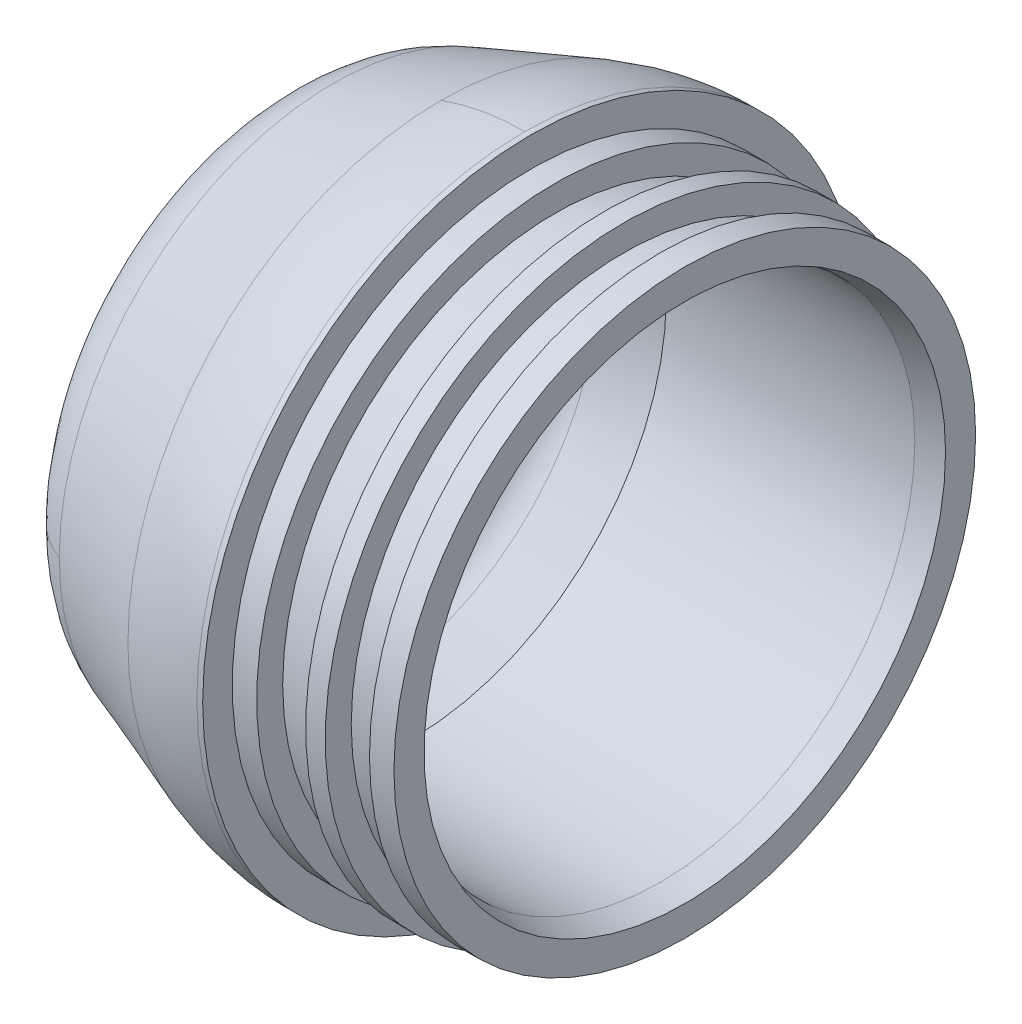
ISO-10303-21;
HEADER;
FILE_DESCRIPTION(('STEP AP214'),'2;1');
FILE_NAME('part.step','',(''),(''),'','','');
FILE_SCHEMA(('AUTOMOTIVE_DESIGN { 1 0 10303 214 1 1 1 1 }'));
ENDSEC;
DATA;
#1=APPLICATION_CONTEXT('core data for automotive mechanical design processes');
#2=APPLICATION_PROTOCOL_DEFINITION('international standard','automotive_design',2000,#1);
#3=PRODUCT_CONTEXT('',#1,'mechanical');
#4=PRODUCT('Part','Part','',(#3));
#5=PRODUCT_RELATED_PRODUCT_CATEGORY('part','',(#4));
#6=PRODUCT_DEFINITION_FORMATION('','',#4);
#7=PRODUCT_DEFINITION_CONTEXT('part definition',#1,'design');
#8=PRODUCT_DEFINITION('design','',#6,#7);
#9=PRODUCT_DEFINITION_SHAPE('','',#8);
#10=(LENGTH_UNIT() NAMED_UNIT(*) SI_UNIT(.MILLI.,.METRE.));
#11=(NAMED_UNIT(*) PLANE_ANGLE_UNIT() SI_UNIT($,.RADIAN.));
#12=(NAMED_UNIT(*) SI_UNIT($,.STERADIAN.) SOLID_ANGLE_UNIT());
#13=UNCERTAINTY_MEASURE_WITH_UNIT(LENGTH_MEASURE(1.E-05),#10,'distance_accuracy_value','');
#14=(GEOMETRIC_REPRESENTATION_CONTEXT(3) GLOBAL_UNCERTAINTY_ASSIGNED_CONTEXT((#13)) GLOBAL_UNIT_ASSIGNED_CONTEXT((#10,
#11,#12)) REPRESENTATION_CONTEXT('',''));
#15=CARTESIAN_POINT('',(0.,0.,0.));
#16=DIRECTION('',(0.,0.,1.));
#17=DIRECTION('',(1.,0.,0.));
#18=AXIS2_PLACEMENT_3D('',#15,#16,#17);
#19=CARTESIAN_POINT('',(50.00625,0.,0.));
#20=DIRECTION('',(1.,0.,0.));
#21=DIRECTION('',(0.,0.,-1.));
#22=AXIS2_PLACEMENT_3D('',#19,#20,#21);
#23=CYLINDRICAL_SURFACE('',#22,17.669740938);
#24=CARTESIAN_POINT('',(50.00625,0.,0.));
#25=DIRECTION('',(1.,0.,0.));
#26=DIRECTION('',(0.,0.,-1.));
#27=AXIS2_PLACEMENT_3D('',#24,#25,#26);
#28=CIRCLE('',#27,17.669740938);
#29=CARTESIAN_POINT('',(50.00625,0.,-17.669740938));
#30=VERTEX_POINT('',#29);
#31=EDGE_CURVE('E265',#30,#30,#28,.F.);
#32=ORIENTED_EDGE('',*,*,#31,.F.);
#33=EDGE_LOOP('',(#32));
#34=FACE_BOUND('',#33,.T.);
#35=CARTESIAN_POINT('',(52.3875,0.,0.));
#36=DIRECTION('',(1.,0.,0.));
#37=DIRECTION('',(0.,0.,-1.));
#38=AXIS2_PLACEMENT_3D('',#35,#36,#37);
#39=CIRCLE('',#38,17.669740938);
#40=CARTESIAN_POINT('',(52.3875,0.,-17.669740938));
#41=VERTEX_POINT('',#40);
#42=EDGE_CURVE('E21',#41,#41,#39,.T.);
#43=ORIENTED_EDGE('',*,*,#42,.F.);
#44=EDGE_LOOP('',(#43));
#45=FACE_BOUND('',#44,.T.);
#46=ADVANCED_FACE('F16',(#34,#45),#23,.T.);
#47=CARTESIAN_POINT('',(52.3875,-19.09401224,-19.09401224));
#48=DIRECTION('',(-1.,0.,0.));
#49=DIRECTION('',(0.,0.,1.));
#50=AXIS2_PLACEMENT_3D('',#47,#48,#49);
#51=PLANE('',#50);
#52=ORIENTED_EDGE('',*,*,#42,.T.);
#53=EDGE_LOOP('',(#52));
#54=FACE_BOUND('',#53,.T.);
#55=CARTESIAN_POINT('',(52.3875,0.,0.));
#56=DIRECTION('',(1.,0.,0.));
#57=DIRECTION('',(0.,0.,-1.));
#58=AXIS2_PLACEMENT_3D('',#55,#56,#57);
#59=CIRCLE('',#58,18.867601028);
#60=CARTESIAN_POINT('',(52.3875,0.,-18.867601028));
#61=VERTEX_POINT('',#60);
#62=EDGE_CURVE('E262',#61,#61,#59,.F.);
#63=ORIENTED_EDGE('',*,*,#62,.T.);
#64=EDGE_LOOP('',(#63));
#65=FACE_BOUND('',#64,.T.);
#66=ADVANCED_FACE('F175',(#54,#65),#51,.T.);
#67=CARTESIAN_POINT('',(50.00625,-19.5870576,19.5870576));
#68=DIRECTION('',(1.,0.,0.));
#69=DIRECTION('',(0.,0.,-1.));
#70=AXIS2_PLACEMENT_3D('',#67,#68,#69);
#71=PLANE('',#70);
#72=ORIENTED_EDGE('',*,*,#31,.T.);
#73=EDGE_LOOP('',(#72));
#74=FACE_BOUND('',#73,.T.);
#75=CARTESIAN_POINT('',(50.00625,0.,0.));
#76=DIRECTION('',(1.,0.,0.));
#77=DIRECTION('',(0.,0.,-1.));
#78=AXIS2_PLACEMENT_3D('',#75,#76,#77);
#79=CIRCLE('',#78,19.3548);
#80=CARTESIAN_POINT('',(50.00625,0.,-19.3548));
#81=VERTEX_POINT('',#80);
#82=EDGE_CURVE('E259',#81,#81,#79,.T.);
#83=ORIENTED_EDGE('',*,*,#82,.T.);
#84=EDGE_LOOP('',(#83));
#85=FACE_BOUND('',#84,.T.);
#86=ADVANCED_FACE('F171',(#74,#85),#71,.T.);
#87=CARTESIAN_POINT('',(52.3875,0.,0.));
#88=DIRECTION('',(1.,0.,0.));
#89=DIRECTION('',(0.,0.,-1.));
#90=AXIS2_PLACEMENT_3D('',#87,#88,#89);
#91=CYLINDRICAL_SURFACE('',#90,18.867601028);
#92=ORIENTED_EDGE('',*,*,#62,.F.);
#93=EDGE_LOOP('',(#92));
#94=FACE_BOUND('',#93,.T.);
#95=CARTESIAN_POINT('',(53.975,0.,0.));
#96=DIRECTION('',(1.,0.,0.));
#97=DIRECTION('',(0.,0.,-1.));
#98=AXIS2_PLACEMENT_3D('',#95,#96,#97);
#99=CIRCLE('',#98,18.867601028);
#100=CARTESIAN_POINT('',(53.975,0.,-18.867601028));
#101=VERTEX_POINT('',#100);
#102=EDGE_CURVE('E255',#101,#101,#99,.T.);
#103=ORIENTED_EDGE('',*,*,#102,.F.);
#104=EDGE_LOOP('',(#103));
#105=FACE_BOUND('',#104,.T.);
#106=ADVANCED_FACE('F167',(#94,#105),#91,.T.);
#107=CARTESIAN_POINT('',(48.73625,0.,0.));
#108=DIRECTION('',(1.,0.,0.));
#109=DIRECTION('',(0.,0.,-1.));
#110=AXIS2_PLACEMENT_3D('',#107,#108,#109);
#111=CYLINDRICAL_SURFACE('',#110,19.3548);
#112=CARTESIAN_POINT('',(48.73625,0.,0.));
#113=DIRECTION('',(1.,0.,0.));
#114=DIRECTION('',(0.,0.,-1.));
#115=AXIS2_PLACEMENT_3D('',#112,#113,#114);
#116=CIRCLE('',#115,19.3548);
#117=CARTESIAN_POINT('',(48.73625,0.,-19.3548));
#118=VERTEX_POINT('',#117);
#119=EDGE_CURVE('E251',#118,#118,#116,.F.);
#120=ORIENTED_EDGE('',*,*,#119,.F.);
#121=EDGE_LOOP('',(#120));
#122=FACE_BOUND('',#121,.T.);
#123=ORIENTED_EDGE('',*,*,#82,.F.);
#124=EDGE_LOOP('',(#123));
#125=FACE_BOUND('',#124,.T.);
#126=ADVANCED_FACE('F163',(#122,#125),#111,.T.);
#127=CARTESIAN_POINT('',(53.975,-19.09401224,19.09401224));
#128=DIRECTION('',(1.,0.,0.));
#129=DIRECTION('',(0.,0.,-1.));
#130=AXIS2_PLACEMENT_3D('',#127,#128,#129);
#131=PLANE('',#130);
#132=CARTESIAN_POINT('',(53.975,0.,0.));
#133=DIRECTION('',(1.,0.,0.));
#134=DIRECTION('',(0.,0.,-1.));
#135=AXIS2_PLACEMENT_3D('',#132,#133,#134);
#136=CIRCLE('',#135,16.9164);
#137=CARTESIAN_POINT('',(53.975,0.,-16.9164));
#138=VERTEX_POINT('',#137);
#139=EDGE_CURVE('E248',#138,#138,#136,.T.);
#140=ORIENTED_EDGE('',*,*,#139,.F.);
#141=EDGE_LOOP('',(#140));
#142=FACE_BOUND('',#141,.T.);
#143=ORIENTED_EDGE('',*,*,#102,.T.);
#144=EDGE_LOOP('',(#143));
#145=FACE_BOUND('',#144,.T.);
#146=ADVANCED_FACE('F166',(#142,#145),#131,.T.);
#147=CARTESIAN_POINT('',(48.73625,-19.5870576,-19.5870576));
#148=DIRECTION('',(-1.,0.,0.));
#149=DIRECTION('',(0.,0.,1.));
#150=AXIS2_PLACEMENT_3D('',#147,#148,#149);
#151=PLANE('',#150);
#152=CARTESIAN_POINT('',(48.7362499999999,0.,0.));
#153=DIRECTION('',(1.,0.,0.));
#154=DIRECTION('',(0.,0.,-1.));
#155=AXIS2_PLACEMENT_3D('',#152,#153,#154);
#156=CIRCLE('',#155,18.229579102);
#157=CARTESIAN_POINT('',(48.7362499999999,0.,-18.229579102));
#158=VERTEX_POINT('',#157);
#159=EDGE_CURVE('E244',#158,#158,#156,.T.);
#160=ORIENTED_EDGE('',*,*,#159,.T.);
#161=EDGE_LOOP('',(#160));
#162=FACE_BOUND('',#161,.T.);
#163=ORIENTED_EDGE('',*,*,#119,.T.);
#164=EDGE_LOOP('',(#163));
#165=FACE_BOUND('',#164,.T.);
#166=ADVANCED_FACE('F161',(#162,#165),#151,.T.);
#167=CARTESIAN_POINT('',(52.3875,0.,0.));
#168=DIRECTION('',(1.,0.,0.));
#169=DIRECTION('',(0.,0.,-1.));
#170=AXIS2_PLACEMENT_3D('',#167,#168,#169);
#171=CONICAL_SURFACE('',#170,16.51,0.250617701099011);
#172=ORIENTED_EDGE('',*,*,#139,.T.);
#173=EDGE_LOOP('',(#172));
#174=FACE_BOUND('',#173,.T.);
#175=CARTESIAN_POINT('',(52.3875,0.,0.));
#176=DIRECTION('',(1.,0.,0.));
#177=DIRECTION('',(0.,1.,0.));
#178=AXIS2_PLACEMENT_3D('',#175,#176,#177);
#179=CIRCLE('',#178,16.51);
#180=CARTESIAN_POINT('',(52.3875,16.51,0.));
#181=VERTEX_POINT('',#180);
#182=EDGE_CURVE('E243',#181,#181,#179,.T.);
#183=ORIENTED_EDGE('',*,*,#182,.F.);
#184=EDGE_LOOP('',(#183));
#185=FACE_BOUND('',#184,.T.);
#186=ADVANCED_FACE('F157',(#174,#185),#171,.F.);
#187=CARTESIAN_POINT('',(45.56125,0.,0.));
#188=DIRECTION('',(1.,0.,0.));
#189=DIRECTION('',(0.,0.,-1.));
#190=AXIS2_PLACEMENT_3D('',#187,#188,#189);
#191=CONICAL_SURFACE('',#190,17.669740939,0.174532924970526);
#192=CARTESIAN_POINT('',(45.56125,0.,0.));
#193=DIRECTION('',(1.,0.,0.));
#194=DIRECTION('',(0.,0.,-1.));
#195=AXIS2_PLACEMENT_3D('',#192,#193,#194);
#196=CIRCLE('',#195,17.669740939);
#197=CARTESIAN_POINT('',(45.56125,0.,-17.669740939));
#198=VERTEX_POINT('',#197);
#199=EDGE_CURVE('E239',#198,#198,#196,.F.);
#200=ORIENTED_EDGE('',*,*,#199,.F.);
#201=EDGE_LOOP('',(#200));
#202=FACE_BOUND('',#201,.T.);
#203=ORIENTED_EDGE('',*,*,#159,.F.);
#204=EDGE_LOOP('',(#203));
#205=FACE_BOUND('',#204,.T.);
#206=ADVANCED_FACE('F153',(#202,#205),#191,.T.);
#207=CARTESIAN_POINT('',(36.263698018,0.,0.));
#208=DIRECTION('',(1.,0.,0.));
#209=DIRECTION('',(0.,0.,-1.));
#210=AXIS2_PLACEMENT_3D('',#207,#208,#209);
#211=CYLINDRICAL_SURFACE('',#210,16.51);
#212=ORIENTED_EDGE('',*,*,#182,.T.);
#213=EDGE_LOOP('',(#212));
#214=FACE_BOUND('',#213,.T.);
#215=CARTESIAN_POINT('',(36.263698018,0.,0.));
#216=DIRECTION('',(1.,0.,0.));
#217=DIRECTION('',(0.,1.,0.));
#218=AXIS2_PLACEMENT_3D('',#215,#216,#217);
#219=CIRCLE('',#218,16.509999999);
#220=CARTESIAN_POINT('',(36.263698018,16.509999999,0.));
#221=VERTEX_POINT('',#220);
#222=EDGE_CURVE('E238',#221,#221,#219,.T.);
#223=ORIENTED_EDGE('',*,*,#222,.F.);
#224=EDGE_LOOP('',(#223));
#225=FACE_BOUND('',#224,.T.);
#226=ADVANCED_FACE('F150',(#214,#225),#211,.F.);
#227=CARTESIAN_POINT('',(45.56125,-19.5870576,19.5870576));
#228=DIRECTION('',(1.,0.,0.));
#229=DIRECTION('',(0.,0.,-1.));
#230=AXIS2_PLACEMENT_3D('',#227,#228,#229);
#231=PLANE('',#230);
#232=ORIENTED_EDGE('',*,*,#199,.T.);
#233=EDGE_LOOP('',(#232));
#234=FACE_BOUND('',#233,.T.);
#235=CARTESIAN_POINT('',(45.56125,0.,0.));
#236=DIRECTION('',(1.,0.,0.));
#237=DIRECTION('',(0.,0.,-1.));
#238=AXIS2_PLACEMENT_3D('',#235,#236,#237);
#239=CIRCLE('',#238,19.3548);
#240=CARTESIAN_POINT('',(45.56125,0.,-19.3548));
#241=VERTEX_POINT('',#240);
#242=EDGE_CURVE('E81',#241,#241,#239,.T.);
#243=ORIENTED_EDGE('',*,*,#242,.T.);
#244=EDGE_LOOP('',(#243));
#245=FACE_BOUND('',#244,.T.);
#246=ADVANCED_FACE('F148',(#234,#245),#231,.T.);
#247=CARTESIAN_POINT('',(33.045336045,0.,0.));
#248=DIRECTION('',(1.,0.,0.));
#249=DIRECTION('',(0.,0.,-1.));
#250=AXIS2_PLACEMENT_3D('',#247,#248,#249);
#251=CONICAL_SURFACE('',#250,15.338612039,0.349065850051445);
#252=ORIENTED_EDGE('',*,*,#222,.T.);
#253=EDGE_LOOP('',(#252));
#254=FACE_BOUND('',#253,.T.);
#255=CARTESIAN_POINT('',(33.0453360451629,0.,0.));
#256=DIRECTION('',(-1.,0.,0.));
#257=DIRECTION('',(0.,0.,1.));
#258=AXIS2_PLACEMENT_3D('',#255,#256,#257);
#259=CIRCLE('',#258,15.3386120388692);
#260=CARTESIAN_POINT('',(33.0453360451629,0.,15.3386120388692));
#261=VERTEX_POINT('',#260);
#262=CARTESIAN_POINT('',(33.0453360451629,0.,-15.3386120388692));
#263=VERTEX_POINT('',#262);
#264=EDGE_CURVE('E69',#261,#263,#259,.T.);
#265=ORIENTED_EDGE('',*,*,#264,.T.);
#266=CARTESIAN_POINT('',(33.0453360451629,0.,0.));
#267=DIRECTION('',(-1.,0.,0.));
#268=DIRECTION('',(0.,0.,1.));
#269=AXIS2_PLACEMENT_3D('',#266,#267,#268);
#270=CIRCLE('',#269,15.3386120388692);
#271=EDGE_CURVE('E74',#263,#261,#270,.T.);
#272=ORIENTED_EDGE('',*,*,#271,.T.);
#273=EDGE_LOOP('',(#265,#272));
#274=FACE_BOUND('',#273,.T.);
#275=ADVANCED_FACE('F83',(#254,#274),#251,.F.);
#276=CARTESIAN_POINT('',(43.97375,0.,0.));
#277=DIRECTION('',(1.,0.,0.));
#278=DIRECTION('',(0.,0.,-1.));
#279=AXIS2_PLACEMENT_3D('',#276,#277,#278);
#280=CYLINDRICAL_SURFACE('',#279,19.3548);
#281=ORIENTED_EDGE('',*,*,#242,.F.);
#282=EDGE_LOOP('',(#281));
#283=FACE_BOUND('',#282,.T.);
#284=CARTESIAN_POINT('',(43.97375,0.,0.));
#285=DIRECTION('',(1.,0.,0.));
#286=DIRECTION('',(0.,0.,-1.));
#287=AXIS2_PLACEMENT_3D('',#284,#285,#286);
#288=CIRCLE('',#287,19.3548);
#289=CARTESIAN_POINT('',(43.97375,0.,-19.3548));
#290=VERTEX_POINT('',#289);
#291=EDGE_CURVE('E96',#290,#290,#288,.F.);
#292=ORIENTED_EDGE('',*,*,#291,.F.);
#293=EDGE_LOOP('',(#292));
#294=FACE_BOUND('',#293,.T.);
#295=ADVANCED_FACE('F133',(#283,#294),#280,.T.);
#296=CARTESIAN_POINT('',(33.348616493,0.,15.432117346));
#297=CARTESIAN_POINT('',(33.348616493,-30.864234692,15.432117346));
#298=CARTESIAN_POINT('',(33.348616493,-30.864234692,-15.432117346));
#299=CARTESIAN_POINT('',(33.348616493,0.,-15.432117346));
#300=CARTESIAN_POINT('',(31.752389926,0.,15.026121743));
#301=CARTESIAN_POINT('',(31.752389926,-30.052243487,15.026121743));
#302=CARTESIAN_POINT('',(31.752389926,-30.052243487,-15.026121743));
#303=CARTESIAN_POINT('',(31.752389926,0.,-15.026121743));
#304=CARTESIAN_POINT('',(30.807681208,0.,13.676937871));
#305=CARTESIAN_POINT('',(30.807681208,-27.353875742,13.676937871));
#306=CARTESIAN_POINT('',(30.807681208,-27.353875742,-13.676937871));
#307=CARTESIAN_POINT('',(30.807681208,0.,-13.676937871));
#308=CARTESIAN_POINT('',(30.972111775,0.,12.03811687));
#309=CARTESIAN_POINT('',(30.972111775,-24.07623374,12.03811687));
#310=CARTESIAN_POINT('',(30.972111775,-24.07623374,-12.03811687));
#311=CARTESIAN_POINT('',(30.972111775,0.,-12.03811687));
#312=(BOUNDED_SURFACE() B_SPLINE_SURFACE(3,3,((#296,#297,#298,#299),(#300,#301,#302,#303),(#304,
#305,#306,#307),(#308,#309,#310,#311)),.UNSPECIFIED.,.F.,.F.,
.F.) B_SPLINE_SURFACE_WITH_KNOTS((4,4),(4,4),(0.,1.),(0.,1.),
.UNSPECIFIED.) GEOMETRIC_REPRESENTATION_ITEM() RATIONAL_B_SPLINE_SURFACE(((1.,0.333333333333333,
0.333333333333333,1.),(0.838531733818192,0.279510577939397,0.279510577939397,0.838531733818192),
(0.838531733818192,0.279510577939397,0.279510577939397,0.838531733818192),(1.,0.333333333333333,
0.333333333333333,1.))) REPRESENTATION_ITEM('') SURFACE());
#313=CARTESIAN_POINT('',(33.348616493,0.,15.432117346));
#314=CARTESIAN_POINT('',(31.752389926,0.,15.026121743));
#315=CARTESIAN_POINT('',(30.807681208,0.,13.676937871));
#316=CARTESIAN_POINT('',(30.972111775,0.,12.03811687));
#317=(BOUNDED_CURVE() B_SPLINE_CURVE(3,(#313,#314,#315,#316),.UNSPECIFIED.,.F.,
.F.) B_SPLINE_CURVE_WITH_KNOTS((4,4),(0.,1.),
.UNSPECIFIED.) CURVE() GEOMETRIC_REPRESENTATION_ITEM() RATIONAL_B_SPLINE_CURVE((1.,
0.838531733818192,0.838531733818192,1.)) REPRESENTATION_ITEM(''));
#318=CARTESIAN_POINT('',(30.9562499999328,0.,12.3550879650064));
#319=VERTEX_POINT('',#318);
#320=EDGE_CURVE('E78',#319,#261,#317,.F.);
#321=CARTESIAN_POINT('',(33.348616493,0.,-15.432117346));
#322=CARTESIAN_POINT('',(31.752389926,0.,-15.026121743));
#323=CARTESIAN_POINT('',(30.807681208,0.,-13.676937871));
#324=CARTESIAN_POINT('',(30.972111775,0.,-12.03811687));
#325=(BOUNDED_CURVE() B_SPLINE_CURVE(3,(#321,#322,#323,#324),.UNSPECIFIED.,.F.,
.F.) B_SPLINE_CURVE_WITH_KNOTS((4,4),(0.,1.),
.UNSPECIFIED.) CURVE() GEOMETRIC_REPRESENTATION_ITEM() RATIONAL_B_SPLINE_CURVE((1.,
0.838531733818192,0.838531733818192,1.)) REPRESENTATION_ITEM(''));
#326=CARTESIAN_POINT('',(30.9562499999328,0.,-12.3550879650064));
#327=VERTEX_POINT('',#326);
#328=EDGE_CURVE('E76',#263,#327,#325,.T.);
#329=CARTESIAN_POINT('',(30.956249999888,0.,-12.3550879675008));
#330=CARTESIAN_POINT('',(30.956249999888,-24.7101759350153,-12.3550879675008));
#331=CARTESIAN_POINT('',(30.956249999888,-24.7101759350153,12.3550879675008));
#332=CARTESIAN_POINT('',(30.956249999888,0.,12.3550879675008));
#333=(BOUNDED_CURVE() B_SPLINE_CURVE(3,(#329,#330,#331,#332),.UNSPECIFIED.,.F.,
.F.) B_SPLINE_CURVE_WITH_KNOTS((4,4),(0.,1.),
.UNSPECIFIED.) CURVE() GEOMETRIC_REPRESENTATION_ITEM() RATIONAL_B_SPLINE_CURVE((0.966273053591873,
0.322091017863957,0.322091017863957,0.966273053591873)) REPRESENTATION_ITEM(''));
#334=EDGE_CURVE('E118',#319,#327,#333,.F.);
#335=ORIENTED_EDGE('',*,*,#320,.T.);
#336=ORIENTED_EDGE('',*,*,#271,.F.);
#337=ORIENTED_EDGE('',*,*,#328,.T.);
#338=ORIENTED_EDGE('',*,*,#334,.F.);
#339=EDGE_LOOP('',(#335,#336,#337,#338));
#340=FACE_BOUND('',#339,.T.);
#341=ADVANCED_FACE('F75',(#340),#312,.F.);
#342=CARTESIAN_POINT('',(33.348616493,0.,-15.432117346));
#343=CARTESIAN_POINT('',(33.348616493,30.864234692,-15.432117346));
#344=CARTESIAN_POINT('',(33.348616493,30.864234692,15.432117346));
#345=CARTESIAN_POINT('',(33.348616493,0.,15.432117346));
#346=CARTESIAN_POINT('',(31.752389926,0.,-15.026121743));
#347=CARTESIAN_POINT('',(31.752389926,30.052243487,-15.026121743));
#348=CARTESIAN_POINT('',(31.752389926,30.052243487,15.026121743));
#349=CARTESIAN_POINT('',(31.752389926,0.,15.026121743));
#350=CARTESIAN_POINT('',(30.807681208,0.,-13.676937871));
#351=CARTESIAN_POINT('',(30.807681208,27.353875742,-13.676937871));
#352=CARTESIAN_POINT('',(30.807681208,27.353875742,13.676937871));
#353=CARTESIAN_POINT('',(30.807681208,0.,13.676937871));
#354=CARTESIAN_POINT('',(30.972111775,0.,-12.03811687));
#355=CARTESIAN_POINT('',(30.972111775,24.07623374,-12.03811687));
#356=CARTESIAN_POINT('',(30.972111775,24.07623374,12.03811687));
#357=CARTESIAN_POINT('',(30.972111775,0.,12.03811687));
#358=(BOUNDED_SURFACE() B_SPLINE_SURFACE(3,3,((#342,#343,#344,#345),(#346,#347,#348,#349),(#350,
#351,#352,#353),(#354,#355,#356,#357)),.UNSPECIFIED.,.F.,.F.,
.F.) B_SPLINE_SURFACE_WITH_KNOTS((4,4),(4,4),(0.,1.),(0.,1.),
.UNSPECIFIED.) GEOMETRIC_REPRESENTATION_ITEM() RATIONAL_B_SPLINE_SURFACE(((1.,0.333333333333333,
0.333333333333333,1.),(0.838531733818192,0.279510577939397,0.279510577939397,0.838531733818192),
(0.838531733818192,0.279510577939397,0.279510577939397,0.838531733818192),(1.,0.333333333333333,
0.333333333333333,1.))) REPRESENTATION_ITEM('') SURFACE());
#359=CARTESIAN_POINT('',(30.956249999888,0.,12.3550879675008));
#360=CARTESIAN_POINT('',(30.956249999888,24.7101759350153,12.3550879675008));
#361=CARTESIAN_POINT('',(30.956249999888,24.7101759350153,-12.3550879675008));
#362=CARTESIAN_POINT('',(30.956249999888,0.,-12.3550879675008));
#363=(BOUNDED_CURVE() B_SPLINE_CURVE(3,(#359,#360,#361,#362),.UNSPECIFIED.,.F.,
.F.) B_SPLINE_CURVE_WITH_KNOTS((4,4),(0.,1.),
.UNSPECIFIED.) CURVE() GEOMETRIC_REPRESENTATION_ITEM() RATIONAL_B_SPLINE_CURVE((0.966273053591873,
0.322091017863957,0.322091017863957,0.966273053591873)) REPRESENTATION_ITEM(''));
#364=EDGE_CURVE('E88',#327,#319,#363,.F.);
#365=ORIENTED_EDGE('',*,*,#364,.F.);
#366=ORIENTED_EDGE('',*,*,#328,.F.);
#367=ORIENTED_EDGE('',*,*,#264,.F.);
#368=ORIENTED_EDGE('',*,*,#320,.F.);
#369=EDGE_LOOP('',(#365,#366,#367,#368));
#370=FACE_BOUND('',#369,.T.);
#371=ADVANCED_FACE('F86',(#370),#358,.F.);
#372=CARTESIAN_POINT('',(43.97375,-21.52777,21.52777));
#373=DIRECTION('',(1.,0.,0.));
#374=DIRECTION('',(0.,0.,-1.));
#375=AXIS2_PLACEMENT_3D('',#372,#373,#374);
#376=PLANE('',#375);
#377=ORIENTED_EDGE('',*,*,#291,.T.);
#378=EDGE_LOOP('',(#377));
#379=FACE_BOUND('',#378,.T.);
#380=CARTESIAN_POINT('',(43.97375,0.,0.));
#381=DIRECTION('',(1.,0.,0.));
#382=DIRECTION('',(0.,0.,-1.));
#383=AXIS2_PLACEMENT_3D('',#380,#381,#382);
#384=CIRCLE('',#383,21.2725);
#385=CARTESIAN_POINT('',(43.97375,0.,-21.2725));
#386=VERTEX_POINT('',#385);
#387=EDGE_CURVE('E218',#386,#386,#384,.T.);
#388=ORIENTED_EDGE('',*,*,#387,.T.);
#389=EDGE_LOOP('',(#388));
#390=FACE_BOUND('',#389,.T.);
#391=ADVANCED_FACE('F192',(#379,#390),#376,.T.);
#392=CARTESIAN_POINT('',(30.95625,-12.503349023,12.503349023));
#393=DIRECTION('',(1.,0.,0.));
#394=DIRECTION('',(0.,0.,-1.));
#395=AXIS2_PLACEMENT_3D('',#392,#393,#394);
#396=PLANE('',#395);
#397=CARTESIAN_POINT('',(30.95625,0.,0.));
#398=DIRECTION('',(1.,0.,0.));
#399=DIRECTION('',(0.,0.,-1.));
#400=AXIS2_PLACEMENT_3D('',#397,#398,#399);
#401=CIRCLE('',#400,5.588);
#402=CARTESIAN_POINT('',(30.95625,0.,-5.588));
#403=VERTEX_POINT('',#402);
#404=EDGE_CURVE('E295',#403,#403,#401,.T.);
#405=ORIENTED_EDGE('',*,*,#404,.F.);
#406=EDGE_LOOP('',(#405));
#407=FACE_BOUND('',#406,.T.);
#408=ORIENTED_EDGE('',*,*,#334,.T.);
#409=ORIENTED_EDGE('',*,*,#364,.T.);
#410=EDGE_LOOP('',(#408,#409));
#411=FACE_BOUND('',#410,.T.);
#412=ADVANCED_FACE('F194',(#407,#411),#396,.T.);
#413=CARTESIAN_POINT('',(43.597940819,0.,0.));
#414=DIRECTION('',(1.,0.,0.));
#415=DIRECTION('',(0.,0.,-1.));
#416=AXIS2_PLACEMENT_3D('',#413,#414,#415);
#417=CYLINDRICAL_SURFACE('',#416,21.2725);
#418=CARTESIAN_POINT('',(43.597940819,0.,0.));
#419=DIRECTION('',(-1.,0.,0.));
#420=DIRECTION('',(0.,0.,1.));
#421=AXIS2_PLACEMENT_3D('',#418,#419,#420);
#422=CIRCLE('',#421,21.2725);
#423=CARTESIAN_POINT('',(43.597940819,21.2725,-9.55067480375112E-10));
#424=VERTEX_POINT('',#423);
#425=CARTESIAN_POINT('',(43.597940819,-21.2725,-2.18153134154619E-09));
#426=VERTEX_POINT('',#425);
#427=EDGE_CURVE('E283',#424,#426,#422,.T.);
#428=ORIENTED_EDGE('',*,*,#427,.F.);
#429=CARTESIAN_POINT('',(43.597940819,0.,0.));
#430=DIRECTION('',(-1.,0.,0.));
#431=DIRECTION('',(0.,0.,1.));
#432=AXIS2_PLACEMENT_3D('',#429,#430,#431);
#433=CIRCLE('',#432,21.2725);
#434=EDGE_CURVE('E223',#426,#424,#433,.T.);
#435=ORIENTED_EDGE('',*,*,#434,.F.);
#436=EDGE_LOOP('',(#428,#435));
#437=FACE_BOUND('',#436,.T.);
#438=ORIENTED_EDGE('',*,*,#387,.F.);
#439=EDGE_LOOP('',(#438));
#440=FACE_BOUND('',#439,.T.);
#441=ADVANCED_FACE('F198',(#437,#440),#417,.T.);
#442=CARTESIAN_POINT('',(38.168371043,-20.315120355,0.));
#443=CARTESIAN_POINT('',(38.168371043,-20.315120355,40.63024071));
#444=CARTESIAN_POINT('',(38.168371043,20.315120355,40.63024071));
#445=CARTESIAN_POINT('',(38.168371043,20.315120355,0.));
#446=CARTESIAN_POINT('',(39.912985849,-20.950108215,0.));
#447=CARTESIAN_POINT('',(39.912985849,-20.950108215,41.900216429));
#448=CARTESIAN_POINT('',(39.912985849,20.950108215,41.900216429));
#449=CARTESIAN_POINT('',(39.912985849,20.950108215,0.));
#450=CARTESIAN_POINT('',(41.741360521,-21.2725,0.));
#451=CARTESIAN_POINT('',(41.741360521,-21.2725,42.545));
#452=CARTESIAN_POINT('',(41.741360521,21.2725,42.545));
#453=CARTESIAN_POINT('',(41.741360521,21.2725,0.));
#454=CARTESIAN_POINT('',(43.597940819,-21.2725,0.));
#455=CARTESIAN_POINT('',(43.597940819,-21.2725,42.545));
#456=CARTESIAN_POINT('',(43.597940819,21.2725,42.545));
#457=CARTESIAN_POINT('',(43.597940819,21.2725,0.));
#458=(BOUNDED_SURFACE() B_SPLINE_SURFACE(3,3,((#442,#443,#444,#445),(#446,#447,#448,#449),(#450,
#451,#452,#453),(#454,#455,#456,#457)),.UNSPECIFIED.,.F.,.F.,
.F.) B_SPLINE_SURFACE_WITH_KNOTS((4,4),(4,4),(0.,1.),(0.,1.),
.UNSPECIFIED.) GEOMETRIC_REPRESENTATION_ITEM() RATIONAL_B_SPLINE_SURFACE(((1.,0.333333333333333,
0.333333333333333,1.),(0.989871835341468,0.329957278447156,0.329957278447156,0.989871835341468),
(0.989871835341468,0.329957278447156,0.329957278447156,0.989871835341468),(1.,0.333333333333333,
0.333333333333333,1.))) REPRESENTATION_ITEM('') SURFACE());
#459=CARTESIAN_POINT('',(38.1683710440001,0.,0.));
#460=DIRECTION('',(1.,0.,0.));
#461=DIRECTION('',(0.,1.,0.));
#462=AXIS2_PLACEMENT_3D('',#459,#460,#461);
#463=CIRCLE('',#462,20.315120354);
#464=CARTESIAN_POINT('',(38.16837104375,20.31512035425,-1.82416836855207E-09));
#465=VERTEX_POINT('',#464);
#466=CARTESIAN_POINT('',(38.16837104375,-20.31512035425,-6.25005125296048E-09));
#467=VERTEX_POINT('',#466);
#468=EDGE_CURVE('E292',#465,#467,#463,.T.);
#469=CARTESIAN_POINT('',(38.168371043,-20.315120355,0.));
#470=CARTESIAN_POINT('',(39.912985849,-20.950108215,0.));
#471=CARTESIAN_POINT('',(41.741360521,-21.2725,0.));
#472=CARTESIAN_POINT('',(43.597940819,-21.2725,0.));
#473=(BOUNDED_CURVE() B_SPLINE_CURVE(3,(#469,#470,#471,#472),.UNSPECIFIED.,.F.,
.F.) B_SPLINE_CURVE_WITH_KNOTS((4,4),(0.,1.),
.UNSPECIFIED.) CURVE() GEOMETRIC_REPRESENTATION_ITEM() RATIONAL_B_SPLINE_CURVE((1.,
0.989871835341468,0.989871835341468,1.)) REPRESENTATION_ITEM(''));
#474=EDGE_CURVE('E285',#426,#467,#473,.F.);
#475=CARTESIAN_POINT('',(38.168371043,20.315120355,0.));
#476=CARTESIAN_POINT('',(39.912985849,20.950108215,0.));
#477=CARTESIAN_POINT('',(41.741360521,21.2725,0.));
#478=CARTESIAN_POINT('',(43.597940819,21.2725,0.));
#479=(BOUNDED_CURVE() B_SPLINE_CURVE(3,(#475,#476,#477,#478),.UNSPECIFIED.,.F.,
.F.) B_SPLINE_CURVE_WITH_KNOTS((4,4),(0.,1.),
.UNSPECIFIED.) CURVE() GEOMETRIC_REPRESENTATION_ITEM() RATIONAL_B_SPLINE_CURVE((1.,
0.989871835341468,0.989871835341468,1.)) REPRESENTATION_ITEM(''));
#480=EDGE_CURVE('E286',#465,#424,#479,.T.);
#481=ORIENTED_EDGE('',*,*,#468,.T.);
#482=ORIENTED_EDGE('',*,*,#474,.F.);
#483=ORIENTED_EDGE('',*,*,#434,.T.);
#484=ORIENTED_EDGE('',*,*,#480,.F.);
#485=EDGE_LOOP('',(#481,#482,#483,#484));
#486=FACE_BOUND('',#485,.T.);
#487=ADVANCED_FACE('F347',(#486),#458,.T.);
#488=CARTESIAN_POINT('',(26.9875,0.,0.));
#489=DIRECTION('',(1.,0.,0.));
#490=DIRECTION('',(0.,0.,-1.));
#491=AXIS2_PLACEMENT_3D('',#488,#489,#490);
#492=CYLINDRICAL_SURFACE('',#491,5.588);
#493=ORIENTED_EDGE('',*,*,#404,.T.);
#494=EDGE_LOOP('',(#493));
#495=FACE_BOUND('',#494,.T.);
#496=CARTESIAN_POINT('',(26.9875,0.,0.));
#497=DIRECTION('',(1.,0.,0.));
#498=DIRECTION('',(0.,0.,-1.));
#499=AXIS2_PLACEMENT_3D('',#496,#497,#498);
#500=CIRCLE('',#499,5.588);
#501=CARTESIAN_POINT('',(26.9875,0.,-5.588));
#502=VERTEX_POINT('',#501);
#503=EDGE_CURVE('E413',#502,#502,#500,.T.);
#504=ORIENTED_EDGE('',*,*,#503,.F.);
#505=EDGE_LOOP('',(#504));
#506=FACE_BOUND('',#505,.T.);
#507=ADVANCED_FACE('F339',(#495,#506),#492,.F.);
#508=CARTESIAN_POINT('',(38.168371043,20.315120355,0.));
#509=CARTESIAN_POINT('',(38.168371043,20.315120355,-40.63024071));
#510=CARTESIAN_POINT('',(38.168371043,-20.315120355,-40.63024071));
#511=CARTESIAN_POINT('',(38.168371043,-20.315120355,0.));
#512=CARTESIAN_POINT('',(39.912985849,20.950108215,0.));
#513=CARTESIAN_POINT('',(39.912985849,20.950108215,-41.900216429));
#514=CARTESIAN_POINT('',(39.912985849,-20.950108215,-41.900216429));
#515=CARTESIAN_POINT('',(39.912985849,-20.950108215,0.));
#516=CARTESIAN_POINT('',(41.741360521,21.2725,0.));
#517=CARTESIAN_POINT('',(41.741360521,21.2725,-42.545));
#518=CARTESIAN_POINT('',(41.741360521,-21.2725,-42.545));
#519=CARTESIAN_POINT('',(41.741360521,-21.2725,0.));
#520=CARTESIAN_POINT('',(43.597940819,21.2725,0.));
#521=CARTESIAN_POINT('',(43.597940819,21.2725,-42.545));
#522=CARTESIAN_POINT('',(43.597940819,-21.2725,-42.545));
#523=CARTESIAN_POINT('',(43.597940819,-21.2725,0.));
#524=(BOUNDED_SURFACE() B_SPLINE_SURFACE(3,3,((#508,#509,#510,#511),(#512,#513,#514,#515),(#516,
#517,#518,#519),(#520,#521,#522,#523)),.UNSPECIFIED.,.F.,.F.,
.F.) B_SPLINE_SURFACE_WITH_KNOTS((4,4),(4,4),(0.,1.),(0.,1.),
.UNSPECIFIED.) GEOMETRIC_REPRESENTATION_ITEM() RATIONAL_B_SPLINE_SURFACE(((1.,0.333333333333333,
0.333333333333333,1.),(0.989871835341468,0.329957278447156,0.329957278447156,0.989871835341468),
(0.989871835341468,0.329957278447156,0.329957278447156,0.989871835341468),(1.,0.333333333333333,
0.333333333333333,1.))) REPRESENTATION_ITEM('') SURFACE());
#525=CARTESIAN_POINT('',(38.1683710440001,0.,0.));
#526=DIRECTION('',(1.,0.,0.));
#527=DIRECTION('',(0.,1.,0.));
#528=AXIS2_PLACEMENT_3D('',#525,#526,#527);
#529=CIRCLE('',#528,20.315120354);
#530=EDGE_CURVE('E308',#467,#465,#529,.T.);
#531=ORIENTED_EDGE('',*,*,#474,.T.);
#532=ORIENTED_EDGE('',*,*,#530,.T.);
#533=ORIENTED_EDGE('',*,*,#480,.T.);
#534=ORIENTED_EDGE('',*,*,#427,.T.);
#535=EDGE_LOOP('',(#531,#532,#533,#534));
#536=FACE_BOUND('',#535,.T.);
#537=ADVANCED_FACE('F329',(#536),#524,.T.);
#538=CARTESIAN_POINT('',(26.9875,-11.940914568,-11.940914422));
#539=DIRECTION('',(-1.,0.,0.));
#540=DIRECTION('',(0.,0.,1.));
#541=AXIS2_PLACEMENT_3D('',#538,#539,#540);
#542=PLANE('',#541);
#543=ORIENTED_EDGE('',*,*,#503,.T.);
#544=EDGE_LOOP('',(#543));
#545=FACE_BOUND('',#544,.T.);
#546=CARTESIAN_POINT('',(26.9875,0.,11.799298234));
#547=CARTESIAN_POINT('',(26.9875,-23.598596469,11.799298234));
#548=CARTESIAN_POINT('',(26.9875,-23.598596469,-11.799298234));
#549=CARTESIAN_POINT('',(26.9875,0.,-11.799298234));
#550=(BOUNDED_CURVE() B_SPLINE_CURVE(3,(#546,#547,#548,#549),.UNSPECIFIED.,.F.,
.F.) B_SPLINE_CURVE_WITH_KNOTS((4,4),(0.,1.),
.UNSPECIFIED.) CURVE() GEOMETRIC_REPRESENTATION_ITEM() RATIONAL_B_SPLINE_CURVE((1.,
0.333333333333333,0.333333333333333,1.)) REPRESENTATION_ITEM(''));
#551=CARTESIAN_POINT('',(26.9875,3.45463518902633E-09,11.7992982339317));
#552=VERTEX_POINT('',#551);
#553=CARTESIAN_POINT('',(26.9875,3.45463484208164E-09,-11.7992982339317));
#554=VERTEX_POINT('',#553);
#555=EDGE_CURVE('E28',#552,#554,#550,.T.);
#556=ORIENTED_EDGE('',*,*,#555,.F.);
#557=CARTESIAN_POINT('',(26.9875,0.,-11.799298234));
#558=CARTESIAN_POINT('',(26.9875,23.598596469,-11.799298234));
#559=CARTESIAN_POINT('',(26.9875,23.598596469,11.799298234));
#560=CARTESIAN_POINT('',(26.9875,0.,11.799298234));
#561=(BOUNDED_CURVE() B_SPLINE_CURVE(3,(#557,#558,#559,#560),.UNSPECIFIED.,.F.,
.F.) B_SPLINE_CURVE_WITH_KNOTS((4,4),(0.,1.),
.UNSPECIFIED.) CURVE() GEOMETRIC_REPRESENTATION_ITEM() RATIONAL_B_SPLINE_CURVE((1.,
0.333333333333333,0.333333333333333,1.)) REPRESENTATION_ITEM(''));
#562=EDGE_CURVE('E418',#554,#552,#561,.T.);
#563=ORIENTED_EDGE('',*,*,#562,.F.);
#564=EDGE_LOOP('',(#556,#563));
#565=FACE_BOUND('',#564,.T.);
#566=ADVANCED_FACE('F18',(#545,#565),#542,.T.);
#567=CARTESIAN_POINT('',(31.16567209,0.,-17.766346376));
#568=CARTESIAN_POINT('',(31.16567209,35.532692753,-17.766346376));
#569=CARTESIAN_POINT('',(31.16567209,35.532692753,17.766346376));
#570=CARTESIAN_POINT('',(31.16567209,0.,17.766346376));
#571=CARTESIAN_POINT('',(28.57115827,0.,-16.822020574));
#572=CARTESIAN_POINT('',(28.57115827,33.644041147,-16.822020574));
#573=CARTESIAN_POINT('',(28.57115827,33.644041147,16.822020574));
#574=CARTESIAN_POINT('',(28.57115827,0.,16.822020574));
#575=CARTESIAN_POINT('',(26.9875,0.,-14.560322171));
#576=CARTESIAN_POINT('',(26.9875,29.120644343,-14.560322171));
#577=CARTESIAN_POINT('',(26.9875,29.120644343,14.560322171));
#578=CARTESIAN_POINT('',(26.9875,0.,14.560322171));
#579=CARTESIAN_POINT('',(26.9875,0.,-11.799298234));
#580=CARTESIAN_POINT('',(26.9875,23.598596469,-11.799298234));
#581=CARTESIAN_POINT('',(26.9875,23.598596469,11.799298234));
#582=CARTESIAN_POINT('',(26.9875,0.,11.799298234));
#583=(BOUNDED_SURFACE() B_SPLINE_SURFACE(3,3,((#567,#568,#569,#570),(#571,#572,#573,#574),(#575,
#576,#577,#578),(#579,#580,#581,#582)),.UNSPECIFIED.,.F.,.F.,
.F.) B_SPLINE_SURFACE_WITH_KNOTS((4,4),(4,4),(0.,1.),(0.,1.),
.UNSPECIFIED.) GEOMETRIC_REPRESENTATION_ITEM() RATIONAL_B_SPLINE_SURFACE(((1.,0.333333333333333,
0.333333333333333,1.),(0.879434696192653,0.293144898730885,0.293144898730885,0.879434696192653),
(0.879434696192653,0.293144898730885,0.293144898730885,0.879434696192653),(1.,0.333333333333333,
0.333333333333333,1.))) REPRESENTATION_ITEM('') SURFACE());
#584=CARTESIAN_POINT('',(31.16567209,0.,-17.766346376));
#585=CARTESIAN_POINT('',(28.57115827,0.,-16.822020574));
#586=CARTESIAN_POINT('',(26.9875,0.,-14.560322171));
#587=CARTESIAN_POINT('',(26.9875,0.,-11.799298234));
#588=(BOUNDED_CURVE() B_SPLINE_CURVE(3,(#584,#585,#586,#587),.UNSPECIFIED.,.F.,
.F.) B_SPLINE_CURVE_WITH_KNOTS((4,4),(0.,1.),
.UNSPECIFIED.) CURVE() GEOMETRIC_REPRESENTATION_ITEM() RATIONAL_B_SPLINE_CURVE((1.,
0.879434696192653,0.879434696192653,1.)) REPRESENTATION_ITEM(''));
#589=CARTESIAN_POINT('',(31.16567209,-1.70863323489812E-09,-17.7663463765));
#590=VERTEX_POINT('',#589);
#591=EDGE_CURVE('E11',#554,#590,#588,.F.);
#592=CARTESIAN_POINT('',(31.16567209,0.,17.766346376));
#593=CARTESIAN_POINT('',(28.57115827,0.,16.822020574));
#594=CARTESIAN_POINT('',(26.9875,0.,14.560322171));
#595=CARTESIAN_POINT('',(26.9875,0.,11.799298234));
#596=(BOUNDED_CURVE() B_SPLINE_CURVE(3,(#592,#593,#594,#595),.UNSPECIFIED.,.F.,
.F.) B_SPLINE_CURVE_WITH_KNOTS((4,4),(0.,1.),
.UNSPECIFIED.) CURVE() GEOMETRIC_REPRESENTATION_ITEM() RATIONAL_B_SPLINE_CURVE((1.,
0.879434696192653,0.879434696192653,1.)) REPRESENTATION_ITEM(''));
#597=CARTESIAN_POINT('',(31.16567209,0.,17.766346376));
#598=VERTEX_POINT('',#597);
#599=EDGE_CURVE('E384',#598,#552,#596,.T.);
#600=CARTESIAN_POINT('',(31.16567209,0.,0.));
#601=DIRECTION('',(1.,0.,0.));
#602=DIRECTION('',(0.,1.,0.));
#603=AXIS2_PLACEMENT_3D('',#600,#601,#602);
#604=CIRCLE('',#603,17.766346378);
#605=EDGE_CURVE('E305',#598,#590,#604,.F.);
#606=ORIENTED_EDGE('',*,*,#591,.F.);
#607=ORIENTED_EDGE('',*,*,#562,.T.);
#608=ORIENTED_EDGE('',*,*,#599,.F.);
#609=ORIENTED_EDGE('',*,*,#605,.T.);
#610=EDGE_LOOP('',(#606,#607,#608,#609));
#611=FACE_BOUND('',#610,.T.);
#612=ADVANCED_FACE('F314',(#611),#583,.T.);
#613=CARTESIAN_POINT('',(31.16567209,0.,0.));
#614=DIRECTION('',(1.,0.,0.));
#615=DIRECTION('',(0.,0.,-1.));
#616=AXIS2_PLACEMENT_3D('',#613,#614,#615);
#617=CONICAL_SURFACE('',#616,17.766346378,0.349065850047928);
#618=ORIENTED_EDGE('',*,*,#605,.F.);
#619=CARTESIAN_POINT('',(31.16567209,0.,0.));
#620=DIRECTION('',(-1.,0.,0.));
#621=DIRECTION('',(0.,-1.,0.));
#622=AXIS2_PLACEMENT_3D('',#619,#620,#621);
#623=CIRCLE('',#622,17.766346376);
#624=EDGE_CURVE('E36',#590,#598,#623,.T.);
#625=ORIENTED_EDGE('',*,*,#624,.F.);
#626=EDGE_LOOP('',(#618,#625));
#627=FACE_BOUND('',#626,.T.);
#628=ORIENTED_EDGE('',*,*,#468,.F.);
#629=ORIENTED_EDGE('',*,*,#530,.F.);
#630=EDGE_LOOP('',(#628,#629));
#631=FACE_BOUND('',#630,.T.);
#632=ADVANCED_FACE('F326',(#627,#631),#617,.T.);
#633=CARTESIAN_POINT('',(31.16567209,0.,17.766346376));
#634=CARTESIAN_POINT('',(31.16567209,-35.532692753,17.766346376));
#635=CARTESIAN_POINT('',(31.16567209,-35.532692753,-17.766346376));
#636=CARTESIAN_POINT('',(31.16567209,0.,-17.766346376));
#637=CARTESIAN_POINT('',(28.57115827,0.,16.822020574));
#638=CARTESIAN_POINT('',(28.57115827,-33.644041147,16.822020574));
#639=CARTESIAN_POINT('',(28.57115827,-33.644041147,-16.822020574));
#640=CARTESIAN_POINT('',(28.57115827,0.,-16.822020574));
#641=CARTESIAN_POINT('',(26.9875,0.,14.560322171));
#642=CARTESIAN_POINT('',(26.9875,-29.120644343,14.560322171));
#643=CARTESIAN_POINT('',(26.9875,-29.120644343,-14.560322171));
#644=CARTESIAN_POINT('',(26.9875,0.,-14.560322171));
#645=CARTESIAN_POINT('',(26.9875,0.,11.799298234));
#646=CARTESIAN_POINT('',(26.9875,-23.598596469,11.799298234));
#647=CARTESIAN_POINT('',(26.9875,-23.598596469,-11.799298234));
#648=CARTESIAN_POINT('',(26.9875,0.,-11.799298234));
#649=(BOUNDED_SURFACE() B_SPLINE_SURFACE(3,3,((#633,#634,#635,#636),(#637,#638,#639,#640),(#641,
#642,#643,#644),(#645,#646,#647,#648)),.UNSPECIFIED.,.F.,.F.,
.F.) B_SPLINE_SURFACE_WITH_KNOTS((4,4),(4,4),(0.,1.),(0.,1.),
.UNSPECIFIED.) GEOMETRIC_REPRESENTATION_ITEM() RATIONAL_B_SPLINE_SURFACE(((1.,0.333333333333333,
0.333333333333333,1.),(0.879434696192653,0.293144898730885,0.293144898730885,0.879434696192653),
(0.879434696192653,0.293144898730885,0.293144898730885,0.879434696192653),(1.,0.333333333333333,
0.333333333333333,1.))) REPRESENTATION_ITEM('') SURFACE());
#650=ORIENTED_EDGE('',*,*,#591,.T.);
#651=ORIENTED_EDGE('',*,*,#624,.T.);
#652=ORIENTED_EDGE('',*,*,#599,.T.);
#653=ORIENTED_EDGE('',*,*,#555,.T.);
#654=EDGE_LOOP('',(#650,#651,#652,#653));
#655=FACE_BOUND('',#654,.T.);
#656=ADVANCED_FACE('F364',(#655),#649,.T.);
#657=CLOSED_SHELL('',(#46,#66,#86,#106,#126,#146,#166,#186,#206,#226,#246,#275,#295,#341,#371,
#391,#412,#441,#487,#507,#537,#566,#612,#632,#656));
#658=MANIFOLD_SOLID_BREP('B1',#657);
#659=ADVANCED_BREP_SHAPE_REPRESENTATION('',(#18,#658),#14);
#660=SHAPE_DEFINITION_REPRESENTATION(#9,#659);
ENDSEC;
END-ISO-10303-21;
